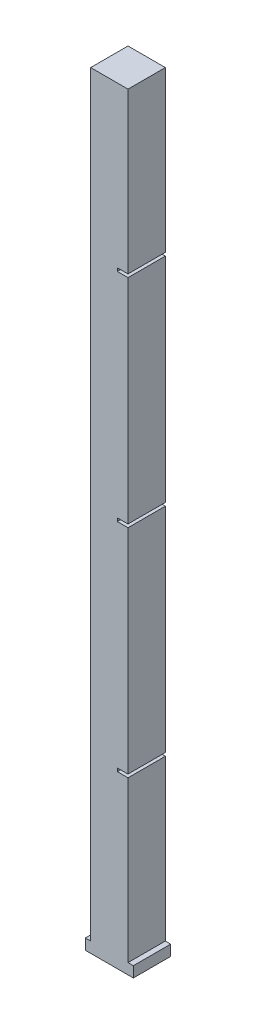
ISO-10303-21;
HEADER;
FILE_DESCRIPTION(('STEP AP214'),'2;1');
FILE_NAME('part.step','',(''),(''),'','','');
FILE_SCHEMA(('AUTOMOTIVE_DESIGN { 1 0 10303 214 1 1 1 1 }'));
ENDSEC;
DATA;
#1=APPLICATION_CONTEXT('core data for automotive mechanical design processes');
#2=APPLICATION_PROTOCOL_DEFINITION('international standard','automotive_design',2000,#1);
#3=PRODUCT_CONTEXT('',#1,'mechanical');
#4=PRODUCT('Part','Part','',(#3));
#5=PRODUCT_RELATED_PRODUCT_CATEGORY('part','',(#4));
#6=PRODUCT_DEFINITION_FORMATION('','',#4);
#7=PRODUCT_DEFINITION_CONTEXT('part definition',#1,'design');
#8=PRODUCT_DEFINITION('design','',#6,#7);
#9=PRODUCT_DEFINITION_SHAPE('','',#8);
#10=(LENGTH_UNIT() NAMED_UNIT(*) SI_UNIT(.MILLI.,.METRE.));
#11=(NAMED_UNIT(*) PLANE_ANGLE_UNIT() SI_UNIT($,.RADIAN.));
#12=(NAMED_UNIT(*) SI_UNIT($,.STERADIAN.) SOLID_ANGLE_UNIT());
#13=UNCERTAINTY_MEASURE_WITH_UNIT(LENGTH_MEASURE(1.E-05),#10,'distance_accuracy_value','');
#14=(GEOMETRIC_REPRESENTATION_CONTEXT(3) GLOBAL_UNCERTAINTY_ASSIGNED_CONTEXT((#13)) GLOBAL_UNIT_ASSIGNED_CONTEXT((#10,
#11,#12)) REPRESENTATION_CONTEXT('',''));
#15=CARTESIAN_POINT('',(0.,0.,0.));
#16=DIRECTION('',(0.,0.,1.));
#17=DIRECTION('',(1.,0.,0.));
#18=AXIS2_PLACEMENT_3D('',#15,#16,#17);
#19=CARTESIAN_POINT('',(0.,0.,70.));
#20=DIRECTION('',(1.,0.,0.));
#21=DIRECTION('',(0.,0.,-1.));
#22=AXIS2_PLACEMENT_3D('',#19,#20,#21);
#23=PLANE('',#22);
#24=DIRECTION('',(0.,-1.,0.));
#25=VECTOR('',#24,1.);
#26=CARTESIAN_POINT('',(0.,0.,0.));
#27=LINE('',#26,#25);
#28=CARTESIAN_POINT('',(0.,20.,0.));
#29=VERTEX_POINT('',#28);
#30=CARTESIAN_POINT('',(0.,0.,0.));
#31=VERTEX_POINT('',#30);
#32=EDGE_CURVE('E201',#29,#31,#27,.T.);
#33=ORIENTED_EDGE('',*,*,#32,.T.);
#34=DIRECTION('',(0.,0.,-1.));
#35=VECTOR('',#34,1.);
#36=CARTESIAN_POINT('',(0.,0.,70.));
#37=LINE('',#36,#35);
#38=CARTESIAN_POINT('',(0.,0.,70.));
#39=VERTEX_POINT('',#38);
#40=EDGE_CURVE('E11',#39,#31,#37,.T.);
#41=ORIENTED_EDGE('',*,*,#40,.F.);
#42=DIRECTION('',(0.,-1.,0.));
#43=VECTOR('',#42,1.);
#44=CARTESIAN_POINT('',(0.,0.,70.));
#45=LINE('',#44,#43);
#46=CARTESIAN_POINT('',(0.,20.,70.));
#47=VERTEX_POINT('',#46);
#48=EDGE_CURVE('E239',#47,#39,#45,.T.);
#49=ORIENTED_EDGE('',*,*,#48,.F.);
#50=DIRECTION('',(0.,0.,-1.));
#51=VECTOR('',#50,1.);
#52=CARTESIAN_POINT('',(0.,20.,70.));
#53=LINE('',#52,#51);
#54=EDGE_CURVE('E197',#47,#29,#53,.T.);
#55=ORIENTED_EDGE('',*,*,#54,.T.);
#56=EDGE_LOOP('',(#33,#41,#49,#55));
#57=FACE_BOUND('',#56,.T.);
#58=ADVANCED_FACE('F33',(#57),#23,.F.);
#59=CARTESIAN_POINT('',(0.,0.,70.));
#60=DIRECTION('',(0.,1.,0.));
#61=DIRECTION('',(0.,0.,1.));
#62=AXIS2_PLACEMENT_3D('',#59,#60,#61);
#63=PLANE('',#62);
#64=DIRECTION('',(1.,0.,0.));
#65=VECTOR('',#64,1.);
#66=CARTESIAN_POINT('',(0.,0.,0.));
#67=LINE('',#66,#65);
#68=CARTESIAN_POINT('',(90.,0.,0.));
#69=VERTEX_POINT('',#68);
#70=EDGE_CURVE('E204',#31,#69,#67,.T.);
#71=ORIENTED_EDGE('',*,*,#70,.T.);
#72=DIRECTION('',(0.,0.,-1.));
#73=VECTOR('',#72,1.);
#74=CARTESIAN_POINT('',(90.,0.,70.));
#75=LINE('',#74,#73);
#76=CARTESIAN_POINT('',(90.,0.,70.));
#77=VERTEX_POINT('',#76);
#78=EDGE_CURVE('E41',#77,#69,#75,.T.);
#79=ORIENTED_EDGE('',*,*,#78,.F.);
#80=DIRECTION('',(1.,0.,0.));
#81=VECTOR('',#80,1.);
#82=CARTESIAN_POINT('',(0.,0.,70.));
#83=LINE('',#82,#81);
#84=EDGE_CURVE('E128',#39,#77,#83,.T.);
#85=ORIENTED_EDGE('',*,*,#84,.F.);
#86=ORIENTED_EDGE('',*,*,#40,.T.);
#87=EDGE_LOOP('',(#71,#79,#85,#86));
#88=FACE_BOUND('',#87,.T.);
#89=ADVANCED_FACE('F357',(#88),#63,.F.);
#90=CARTESIAN_POINT('',(90.,0.,70.));
#91=DIRECTION('',(-1.,0.,0.));
#92=DIRECTION('',(0.,0.,1.));
#93=AXIS2_PLACEMENT_3D('',#90,#91,#92);
#94=PLANE('',#93);
#95=DIRECTION('',(0.,1.,0.));
#96=VECTOR('',#95,1.);
#97=CARTESIAN_POINT('',(90.,0.,0.));
#98=LINE('',#97,#96);
#99=CARTESIAN_POINT('',(90.,20.,0.));
#100=VERTEX_POINT('',#99);
#101=EDGE_CURVE('E206',#69,#100,#98,.T.);
#102=ORIENTED_EDGE('',*,*,#101,.T.);
#103=DIRECTION('',(0.,0.,-1.));
#104=VECTOR('',#103,1.);
#105=CARTESIAN_POINT('',(90.,20.,70.));
#106=LINE('',#105,#104);
#107=CARTESIAN_POINT('',(90.,20.,70.));
#108=VERTEX_POINT('',#107);
#109=EDGE_CURVE('E282',#108,#100,#106,.T.);
#110=ORIENTED_EDGE('',*,*,#109,.F.);
#111=DIRECTION('',(0.,1.,0.));
#112=VECTOR('',#111,1.);
#113=CARTESIAN_POINT('',(90.,0.,70.));
#114=LINE('',#113,#112);
#115=EDGE_CURVE('E290',#77,#108,#114,.T.);
#116=ORIENTED_EDGE('',*,*,#115,.F.);
#117=ORIENTED_EDGE('',*,*,#78,.T.);
#118=EDGE_LOOP('',(#102,#110,#116,#117));
#119=FACE_BOUND('',#118,.T.);
#120=ADVANCED_FACE('F288',(#119),#94,.F.);
#121=CARTESIAN_POINT('',(90.,20.,70.));
#122=DIRECTION('',(0.,-1.,0.));
#123=DIRECTION('',(0.,0.,-1.));
#124=AXIS2_PLACEMENT_3D('',#121,#122,#123);
#125=PLANE('',#124);
#126=DIRECTION('',(-1.,0.,0.));
#127=VECTOR('',#126,1.);
#128=CARTESIAN_POINT('',(90.,20.,0.));
#129=LINE('',#128,#127);
#130=CARTESIAN_POINT('',(80.,20.,0.));
#131=VERTEX_POINT('',#130);
#132=EDGE_CURVE('E208',#100,#131,#129,.T.);
#133=ORIENTED_EDGE('',*,*,#132,.T.);
#134=DIRECTION('',(0.,0.,-1.));
#135=VECTOR('',#134,1.);
#136=CARTESIAN_POINT('',(80.,20.,70.));
#137=LINE('',#136,#135);
#138=CARTESIAN_POINT('',(80.,20.,70.));
#139=VERTEX_POINT('',#138);
#140=EDGE_CURVE('E279',#139,#131,#137,.T.);
#141=ORIENTED_EDGE('',*,*,#140,.F.);
#142=DIRECTION('',(-1.,0.,0.));
#143=VECTOR('',#142,1.);
#144=CARTESIAN_POINT('',(90.,20.,70.));
#145=LINE('',#144,#143);
#146=EDGE_CURVE('E308',#108,#139,#145,.T.);
#147=ORIENTED_EDGE('',*,*,#146,.F.);
#148=ORIENTED_EDGE('',*,*,#109,.T.);
#149=EDGE_LOOP('',(#133,#141,#147,#148));
#150=FACE_BOUND('',#149,.T.);
#151=ADVANCED_FACE('F299',(#150),#125,.F.);
#152=CARTESIAN_POINT('',(80.,20.,70.));
#153=DIRECTION('',(-1.,0.,0.));
#154=DIRECTION('',(0.,0.,1.));
#155=AXIS2_PLACEMENT_3D('',#152,#153,#154);
#156=PLANE('',#155);
#157=DIRECTION('',(0.,1.,0.));
#158=VECTOR('',#157,1.);
#159=CARTESIAN_POINT('',(80.,20.,0.));
#160=LINE('',#159,#158);
#161=CARTESIAN_POINT('',(80.,320.,0.));
#162=VERTEX_POINT('',#161);
#163=EDGE_CURVE('E210',#131,#162,#160,.T.);
#164=ORIENTED_EDGE('',*,*,#163,.T.);
#165=DIRECTION('',(0.,0.,-1.));
#166=VECTOR('',#165,1.);
#167=CARTESIAN_POINT('',(80.,320.,70.));
#168=LINE('',#167,#166);
#169=CARTESIAN_POINT('',(80.,320.,70.));
#170=VERTEX_POINT('',#169);
#171=EDGE_CURVE('E276',#170,#162,#168,.T.);
#172=ORIENTED_EDGE('',*,*,#171,.F.);
#173=DIRECTION('',(0.,1.,0.));
#174=VECTOR('',#173,1.);
#175=CARTESIAN_POINT('',(80.,20.,70.));
#176=LINE('',#175,#174);
#177=EDGE_CURVE('E305',#139,#170,#176,.T.);
#178=ORIENTED_EDGE('',*,*,#177,.F.);
#179=ORIENTED_EDGE('',*,*,#140,.T.);
#180=EDGE_LOOP('',(#164,#172,#178,#179));
#181=FACE_BOUND('',#180,.T.);
#182=ADVANCED_FACE('F303',(#181),#156,.F.);
#183=CARTESIAN_POINT('',(80.,320.,70.));
#184=DIRECTION('',(0.,-1.,0.));
#185=DIRECTION('',(0.,0.,-1.));
#186=AXIS2_PLACEMENT_3D('',#183,#184,#185);
#187=PLANE('',#186);
#188=DIRECTION('',(-1.,0.,0.));
#189=VECTOR('',#188,1.);
#190=CARTESIAN_POINT('',(80.,320.,0.));
#191=LINE('',#190,#189);
#192=CARTESIAN_POINT('',(60.,320.,0.));
#193=VERTEX_POINT('',#192);
#194=EDGE_CURVE('E212',#162,#193,#191,.T.);
#195=ORIENTED_EDGE('',*,*,#194,.T.);
#196=DIRECTION('',(0.,0.,-1.));
#197=VECTOR('',#196,1.);
#198=CARTESIAN_POINT('',(60.,320.,70.));
#199=LINE('',#198,#197);
#200=CARTESIAN_POINT('',(60.,320.,70.));
#201=VERTEX_POINT('',#200);
#202=EDGE_CURVE('E273',#201,#193,#199,.T.);
#203=ORIENTED_EDGE('',*,*,#202,.F.);
#204=DIRECTION('',(-1.,0.,0.));
#205=VECTOR('',#204,1.);
#206=CARTESIAN_POINT('',(80.,320.,70.));
#207=LINE('',#206,#205);
#208=EDGE_CURVE('E307',#170,#201,#207,.T.);
#209=ORIENTED_EDGE('',*,*,#208,.F.);
#210=ORIENTED_EDGE('',*,*,#171,.T.);
#211=EDGE_LOOP('',(#195,#203,#209,#210));
#212=FACE_BOUND('',#211,.T.);
#213=ADVANCED_FACE('F370',(#212),#187,.F.);
#214=CARTESIAN_POINT('',(60.,320.,70.));
#215=DIRECTION('',(-1.,0.,0.));
#216=DIRECTION('',(0.,0.,1.));
#217=AXIS2_PLACEMENT_3D('',#214,#215,#216);
#218=PLANE('',#217);
#219=DIRECTION('',(0.,1.,0.));
#220=VECTOR('',#219,1.);
#221=CARTESIAN_POINT('',(60.,320.,0.));
#222=LINE('',#221,#220);
#223=CARTESIAN_POINT('',(60.,326.,0.));
#224=VERTEX_POINT('',#223);
#225=EDGE_CURVE('E214',#193,#224,#222,.T.);
#226=ORIENTED_EDGE('',*,*,#225,.T.);
#227=DIRECTION('',(0.,0.,-1.));
#228=VECTOR('',#227,1.);
#229=CARTESIAN_POINT('',(60.,326.,70.));
#230=LINE('',#229,#228);
#231=CARTESIAN_POINT('',(60.,326.,70.));
#232=VERTEX_POINT('',#231);
#233=EDGE_CURVE('E270',#232,#224,#230,.T.);
#234=ORIENTED_EDGE('',*,*,#233,.F.);
#235=DIRECTION('',(0.,1.,0.));
#236=VECTOR('',#235,1.);
#237=CARTESIAN_POINT('',(60.,320.,70.));
#238=LINE('',#237,#236);
#239=EDGE_CURVE('E310',#201,#232,#238,.T.);
#240=ORIENTED_EDGE('',*,*,#239,.F.);
#241=ORIENTED_EDGE('',*,*,#202,.T.);
#242=EDGE_LOOP('',(#226,#234,#240,#241));
#243=FACE_BOUND('',#242,.T.);
#244=ADVANCED_FACE('F373',(#243),#218,.F.);
#245=CARTESIAN_POINT('',(60.,326.,70.));
#246=DIRECTION('',(0.,1.,0.));
#247=DIRECTION('',(0.,0.,1.));
#248=AXIS2_PLACEMENT_3D('',#245,#246,#247);
#249=PLANE('',#248);
#250=DIRECTION('',(1.,0.,0.));
#251=VECTOR('',#250,1.);
#252=CARTESIAN_POINT('',(60.,326.,0.));
#253=LINE('',#252,#251);
#254=CARTESIAN_POINT('',(80.,326.,0.));
#255=VERTEX_POINT('',#254);
#256=EDGE_CURVE('E216',#224,#255,#253,.T.);
#257=ORIENTED_EDGE('',*,*,#256,.T.);
#258=DIRECTION('',(0.,0.,-1.));
#259=VECTOR('',#258,1.);
#260=CARTESIAN_POINT('',(80.,326.,70.));
#261=LINE('',#260,#259);
#262=CARTESIAN_POINT('',(80.,326.,70.));
#263=VERTEX_POINT('',#262);
#264=EDGE_CURVE('E267',#263,#255,#261,.T.);
#265=ORIENTED_EDGE('',*,*,#264,.F.);
#266=DIRECTION('',(1.,0.,0.));
#267=VECTOR('',#266,1.);
#268=CARTESIAN_POINT('',(60.,326.,70.));
#269=LINE('',#268,#267);
#270=EDGE_CURVE('E316',#232,#263,#269,.T.);
#271=ORIENTED_EDGE('',*,*,#270,.F.);
#272=ORIENTED_EDGE('',*,*,#233,.T.);
#273=EDGE_LOOP('',(#257,#265,#271,#272));
#274=FACE_BOUND('',#273,.T.);
#275=ADVANCED_FACE('F377',(#274),#249,.F.);
#276=CARTESIAN_POINT('',(80.,326.,70.));
#277=DIRECTION('',(-1.,0.,0.));
#278=DIRECTION('',(0.,0.,1.));
#279=AXIS2_PLACEMENT_3D('',#276,#277,#278);
#280=PLANE('',#279);
#281=DIRECTION('',(0.,1.,0.));
#282=VECTOR('',#281,1.);
#283=CARTESIAN_POINT('',(80.,326.,0.));
#284=LINE('',#283,#282);
#285=CARTESIAN_POINT('',(80.,726.,0.));
#286=VERTEX_POINT('',#285);
#287=EDGE_CURVE('E218',#255,#286,#284,.T.);
#288=ORIENTED_EDGE('',*,*,#287,.T.);
#289=DIRECTION('',(0.,0.,-1.));
#290=VECTOR('',#289,1.);
#291=CARTESIAN_POINT('',(80.,726.,70.));
#292=LINE('',#291,#290);
#293=CARTESIAN_POINT('',(80.,726.,70.));
#294=VERTEX_POINT('',#293);
#295=EDGE_CURVE('E264',#294,#286,#292,.T.);
#296=ORIENTED_EDGE('',*,*,#295,.F.);
#297=DIRECTION('',(0.,1.,0.));
#298=VECTOR('',#297,1.);
#299=CARTESIAN_POINT('',(80.,326.,70.));
#300=LINE('',#299,#298);
#301=EDGE_CURVE('E318',#263,#294,#300,.T.);
#302=ORIENTED_EDGE('',*,*,#301,.F.);
#303=ORIENTED_EDGE('',*,*,#264,.T.);
#304=EDGE_LOOP('',(#288,#296,#302,#303));
#305=FACE_BOUND('',#304,.T.);
#306=ADVANCED_FACE('F381',(#305),#280,.F.);
#307=CARTESIAN_POINT('',(80.,726.,70.));
#308=DIRECTION('',(0.,-1.,0.));
#309=DIRECTION('',(0.,0.,-1.));
#310=AXIS2_PLACEMENT_3D('',#307,#308,#309);
#311=PLANE('',#310);
#312=DIRECTION('',(-1.,0.,0.));
#313=VECTOR('',#312,1.);
#314=CARTESIAN_POINT('',(80.,726.,0.));
#315=LINE('',#314,#313);
#316=CARTESIAN_POINT('',(60.,726.,0.));
#317=VERTEX_POINT('',#316);
#318=EDGE_CURVE('E220',#286,#317,#315,.T.);
#319=ORIENTED_EDGE('',*,*,#318,.T.);
#320=DIRECTION('',(0.,0.,-1.));
#321=VECTOR('',#320,1.);
#322=CARTESIAN_POINT('',(60.,726.,70.));
#323=LINE('',#322,#321);
#324=CARTESIAN_POINT('',(60.,726.,70.));
#325=VERTEX_POINT('',#324);
#326=EDGE_CURVE('E261',#325,#317,#323,.T.);
#327=ORIENTED_EDGE('',*,*,#326,.F.);
#328=DIRECTION('',(-1.,0.,0.));
#329=VECTOR('',#328,1.);
#330=CARTESIAN_POINT('',(80.,726.,70.));
#331=LINE('',#330,#329);
#332=EDGE_CURVE('E320',#294,#325,#331,.T.);
#333=ORIENTED_EDGE('',*,*,#332,.F.);
#334=ORIENTED_EDGE('',*,*,#295,.T.);
#335=EDGE_LOOP('',(#319,#327,#333,#334));
#336=FACE_BOUND('',#335,.T.);
#337=ADVANCED_FACE('F385',(#336),#311,.F.);
#338=CARTESIAN_POINT('',(60.,726.,70.));
#339=DIRECTION('',(-1.,0.,0.));
#340=DIRECTION('',(0.,0.,1.));
#341=AXIS2_PLACEMENT_3D('',#338,#339,#340);
#342=PLANE('',#341);
#343=DIRECTION('',(0.,1.,0.));
#344=VECTOR('',#343,1.);
#345=CARTESIAN_POINT('',(60.,726.,0.));
#346=LINE('',#345,#344);
#347=CARTESIAN_POINT('',(60.,732.,0.));
#348=VERTEX_POINT('',#347);
#349=EDGE_CURVE('E222',#317,#348,#346,.T.);
#350=ORIENTED_EDGE('',*,*,#349,.T.);
#351=DIRECTION('',(0.,0.,-1.));
#352=VECTOR('',#351,1.);
#353=CARTESIAN_POINT('',(60.,732.,70.));
#354=LINE('',#353,#352);
#355=CARTESIAN_POINT('',(60.,732.,70.));
#356=VERTEX_POINT('',#355);
#357=EDGE_CURVE('E258',#356,#348,#354,.T.);
#358=ORIENTED_EDGE('',*,*,#357,.F.);
#359=DIRECTION('',(0.,1.,0.));
#360=VECTOR('',#359,1.);
#361=CARTESIAN_POINT('',(60.,726.,70.));
#362=LINE('',#361,#360);
#363=EDGE_CURVE('E322',#325,#356,#362,.T.);
#364=ORIENTED_EDGE('',*,*,#363,.F.);
#365=ORIENTED_EDGE('',*,*,#326,.T.);
#366=EDGE_LOOP('',(#350,#358,#364,#365));
#367=FACE_BOUND('',#366,.T.);
#368=ADVANCED_FACE('F389',(#367),#342,.F.);
#369=CARTESIAN_POINT('',(60.,732.,70.));
#370=DIRECTION('',(0.,1.,0.));
#371=DIRECTION('',(0.,0.,1.));
#372=AXIS2_PLACEMENT_3D('',#369,#370,#371);
#373=PLANE('',#372);
#374=DIRECTION('',(1.,0.,0.));
#375=VECTOR('',#374,1.);
#376=CARTESIAN_POINT('',(60.,732.,0.));
#377=LINE('',#376,#375);
#378=CARTESIAN_POINT('',(80.,732.,0.));
#379=VERTEX_POINT('',#378);
#380=EDGE_CURVE('E224',#348,#379,#377,.T.);
#381=ORIENTED_EDGE('',*,*,#380,.T.);
#382=DIRECTION('',(0.,0.,-1.));
#383=VECTOR('',#382,1.);
#384=CARTESIAN_POINT('',(80.,732.,70.));
#385=LINE('',#384,#383);
#386=CARTESIAN_POINT('',(80.,732.,70.));
#387=VERTEX_POINT('',#386);
#388=EDGE_CURVE('E255',#387,#379,#385,.T.);
#389=ORIENTED_EDGE('',*,*,#388,.F.);
#390=DIRECTION('',(1.,0.,0.));
#391=VECTOR('',#390,1.);
#392=CARTESIAN_POINT('',(60.,732.,70.));
#393=LINE('',#392,#391);
#394=EDGE_CURVE('E324',#356,#387,#393,.T.);
#395=ORIENTED_EDGE('',*,*,#394,.F.);
#396=ORIENTED_EDGE('',*,*,#357,.T.);
#397=EDGE_LOOP('',(#381,#389,#395,#396));
#398=FACE_BOUND('',#397,.T.);
#399=ADVANCED_FACE('F393',(#398),#373,.F.);
#400=CARTESIAN_POINT('',(80.,732.,70.));
#401=DIRECTION('',(-1.,0.,0.));
#402=DIRECTION('',(0.,0.,1.));
#403=AXIS2_PLACEMENT_3D('',#400,#401,#402);
#404=PLANE('',#403);
#405=DIRECTION('',(0.,1.,0.));
#406=VECTOR('',#405,1.);
#407=CARTESIAN_POINT('',(80.,732.,0.));
#408=LINE('',#407,#406);
#409=CARTESIAN_POINT('',(80.,1132.,0.));
#410=VERTEX_POINT('',#409);
#411=EDGE_CURVE('E226',#379,#410,#408,.T.);
#412=ORIENTED_EDGE('',*,*,#411,.T.);
#413=DIRECTION('',(0.,0.,-1.));
#414=VECTOR('',#413,1.);
#415=CARTESIAN_POINT('',(80.,1132.,70.));
#416=LINE('',#415,#414);
#417=CARTESIAN_POINT('',(80.,1132.,70.));
#418=VERTEX_POINT('',#417);
#419=EDGE_CURVE('E252',#418,#410,#416,.T.);
#420=ORIENTED_EDGE('',*,*,#419,.F.);
#421=DIRECTION('',(0.,1.,0.));
#422=VECTOR('',#421,1.);
#423=CARTESIAN_POINT('',(80.,732.,70.));
#424=LINE('',#423,#422);
#425=EDGE_CURVE('E326',#387,#418,#424,.T.);
#426=ORIENTED_EDGE('',*,*,#425,.F.);
#427=ORIENTED_EDGE('',*,*,#388,.T.);
#428=EDGE_LOOP('',(#412,#420,#426,#427));
#429=FACE_BOUND('',#428,.T.);
#430=ADVANCED_FACE('F397',(#429),#404,.F.);
#431=CARTESIAN_POINT('',(80.,1132.,70.));
#432=DIRECTION('',(0.,-1.,0.));
#433=DIRECTION('',(0.,0.,-1.));
#434=AXIS2_PLACEMENT_3D('',#431,#432,#433);
#435=PLANE('',#434);
#436=DIRECTION('',(-1.,0.,0.));
#437=VECTOR('',#436,1.);
#438=CARTESIAN_POINT('',(80.,1132.,0.));
#439=LINE('',#438,#437);
#440=CARTESIAN_POINT('',(60.,1132.,0.));
#441=VERTEX_POINT('',#440);
#442=EDGE_CURVE('E228',#410,#441,#439,.T.);
#443=ORIENTED_EDGE('',*,*,#442,.T.);
#444=DIRECTION('',(0.,0.,-1.));
#445=VECTOR('',#444,1.);
#446=CARTESIAN_POINT('',(60.,1132.,70.));
#447=LINE('',#446,#445);
#448=CARTESIAN_POINT('',(60.,1132.,70.));
#449=VERTEX_POINT('',#448);
#450=EDGE_CURVE('E249',#449,#441,#447,.T.);
#451=ORIENTED_EDGE('',*,*,#450,.F.);
#452=DIRECTION('',(-1.,0.,0.));
#453=VECTOR('',#452,1.);
#454=CARTESIAN_POINT('',(80.,1132.,70.));
#455=LINE('',#454,#453);
#456=EDGE_CURVE('E328',#418,#449,#455,.T.);
#457=ORIENTED_EDGE('',*,*,#456,.F.);
#458=ORIENTED_EDGE('',*,*,#419,.T.);
#459=EDGE_LOOP('',(#443,#451,#457,#458));
#460=FACE_BOUND('',#459,.T.);
#461=ADVANCED_FACE('F401',(#460),#435,.F.);
#462=CARTESIAN_POINT('',(60.,1132.,70.));
#463=DIRECTION('',(-1.,0.,0.));
#464=DIRECTION('',(0.,0.,1.));
#465=AXIS2_PLACEMENT_3D('',#462,#463,#464);
#466=PLANE('',#465);
#467=DIRECTION('',(0.,1.,0.));
#468=VECTOR('',#467,1.);
#469=CARTESIAN_POINT('',(60.,1132.,0.));
#470=LINE('',#469,#468);
#471=CARTESIAN_POINT('',(60.,1138.,0.));
#472=VERTEX_POINT('',#471);
#473=EDGE_CURVE('E230',#441,#472,#470,.T.);
#474=ORIENTED_EDGE('',*,*,#473,.T.);
#475=DIRECTION('',(0.,0.,-1.));
#476=VECTOR('',#475,1.);
#477=CARTESIAN_POINT('',(60.,1138.,70.));
#478=LINE('',#477,#476);
#479=CARTESIAN_POINT('',(60.,1138.,70.));
#480=VERTEX_POINT('',#479);
#481=EDGE_CURVE('E246',#480,#472,#478,.T.);
#482=ORIENTED_EDGE('',*,*,#481,.F.);
#483=DIRECTION('',(0.,1.,0.));
#484=VECTOR('',#483,1.);
#485=CARTESIAN_POINT('',(60.,1132.,70.));
#486=LINE('',#485,#484);
#487=EDGE_CURVE('E330',#449,#480,#486,.T.);
#488=ORIENTED_EDGE('',*,*,#487,.F.);
#489=ORIENTED_EDGE('',*,*,#450,.T.);
#490=EDGE_LOOP('',(#474,#482,#488,#489));
#491=FACE_BOUND('',#490,.T.);
#492=ADVANCED_FACE('F405',(#491),#466,.F.);
#493=CARTESIAN_POINT('',(60.,1138.,70.));
#494=DIRECTION('',(0.,1.,0.));
#495=DIRECTION('',(0.,0.,1.));
#496=AXIS2_PLACEMENT_3D('',#493,#494,#495);
#497=PLANE('',#496);
#498=DIRECTION('',(1.,0.,0.));
#499=VECTOR('',#498,1.);
#500=CARTESIAN_POINT('',(60.,1138.,0.));
#501=LINE('',#500,#499);
#502=CARTESIAN_POINT('',(80.,1138.,0.));
#503=VERTEX_POINT('',#502);
#504=EDGE_CURVE('E232',#472,#503,#501,.T.);
#505=ORIENTED_EDGE('',*,*,#504,.T.);
#506=DIRECTION('',(0.,0.,-1.));
#507=VECTOR('',#506,1.);
#508=CARTESIAN_POINT('',(80.,1138.,70.));
#509=LINE('',#508,#507);
#510=CARTESIAN_POINT('',(80.,1138.,70.));
#511=VERTEX_POINT('',#510);
#512=EDGE_CURVE('E243',#511,#503,#509,.T.);
#513=ORIENTED_EDGE('',*,*,#512,.F.);
#514=DIRECTION('',(1.,0.,0.));
#515=VECTOR('',#514,1.);
#516=CARTESIAN_POINT('',(60.,1138.,70.));
#517=LINE('',#516,#515);
#518=EDGE_CURVE('E332',#480,#511,#517,.T.);
#519=ORIENTED_EDGE('',*,*,#518,.F.);
#520=ORIENTED_EDGE('',*,*,#481,.T.);
#521=EDGE_LOOP('',(#505,#513,#519,#520));
#522=FACE_BOUND('',#521,.T.);
#523=ADVANCED_FACE('F338',(#522),#497,.F.);
#524=CARTESIAN_POINT('',(80.,1138.,70.));
#525=DIRECTION('',(-1.,0.,0.));
#526=DIRECTION('',(0.,0.,1.));
#527=AXIS2_PLACEMENT_3D('',#524,#525,#526);
#528=PLANE('',#527);
#529=DIRECTION('',(0.,1.,0.));
#530=VECTOR('',#529,1.);
#531=CARTESIAN_POINT('',(80.,1138.,0.));
#532=LINE('',#531,#530);
#533=CARTESIAN_POINT('',(80.,1438.,0.));
#534=VERTEX_POINT('',#533);
#535=EDGE_CURVE('E234',#503,#534,#532,.T.);
#536=ORIENTED_EDGE('',*,*,#535,.T.);
#537=DIRECTION('',(0.,0.,-1.));
#538=VECTOR('',#537,1.);
#539=CARTESIAN_POINT('',(80.,1438.,70.));
#540=LINE('',#539,#538);
#541=CARTESIAN_POINT('',(80.,1438.,70.));
#542=VERTEX_POINT('',#541);
#543=EDGE_CURVE('E192',#542,#534,#540,.T.);
#544=ORIENTED_EDGE('',*,*,#543,.F.);
#545=DIRECTION('',(0.,1.,0.));
#546=VECTOR('',#545,1.);
#547=CARTESIAN_POINT('',(80.,1138.,70.));
#548=LINE('',#547,#546);
#549=EDGE_CURVE('E183',#511,#542,#548,.T.);
#550=ORIENTED_EDGE('',*,*,#549,.F.);
#551=ORIENTED_EDGE('',*,*,#512,.T.);
#552=EDGE_LOOP('',(#536,#544,#550,#551));
#553=FACE_BOUND('',#552,.T.);
#554=ADVANCED_FACE('F342',(#553),#528,.F.);
#555=CARTESIAN_POINT('',(80.,1438.,70.));
#556=DIRECTION('',(0.,-1.,0.));
#557=DIRECTION('',(0.,0.,-1.));
#558=AXIS2_PLACEMENT_3D('',#555,#556,#557);
#559=PLANE('',#558);
#560=DIRECTION('',(-1.,0.,0.));
#561=VECTOR('',#560,1.);
#562=CARTESIAN_POINT('',(80.,1438.,0.));
#563=LINE('',#562,#561);
#564=CARTESIAN_POINT('',(10.,1438.,0.));
#565=VERTEX_POINT('',#564);
#566=EDGE_CURVE('E191',#534,#565,#563,.T.);
#567=ORIENTED_EDGE('',*,*,#566,.T.);
#568=DIRECTION('',(0.,0.,-1.));
#569=VECTOR('',#568,1.);
#570=CARTESIAN_POINT('',(10.,1438.,70.));
#571=LINE('',#570,#569);
#572=CARTESIAN_POINT('',(10.,1438.,70.));
#573=VERTEX_POINT('',#572);
#574=EDGE_CURVE('E188',#573,#565,#571,.T.);
#575=ORIENTED_EDGE('',*,*,#574,.F.);
#576=DIRECTION('',(-1.,0.,0.));
#577=VECTOR('',#576,1.);
#578=CARTESIAN_POINT('',(80.,1438.,70.));
#579=LINE('',#578,#577);
#580=EDGE_CURVE('E177',#542,#573,#579,.T.);
#581=ORIENTED_EDGE('',*,*,#580,.F.);
#582=ORIENTED_EDGE('',*,*,#543,.T.);
#583=EDGE_LOOP('',(#567,#575,#581,#582));
#584=FACE_BOUND('',#583,.T.);
#585=ADVANCED_FACE('F189',(#584),#559,.F.);
#586=CARTESIAN_POINT('',(10.,1438.,70.));
#587=DIRECTION('',(1.,0.,0.));
#588=DIRECTION('',(0.,1.,0.));
#589=AXIS2_PLACEMENT_3D('',#586,#587,#588);
#590=PLANE('',#589);
#591=DIRECTION('',(0.,-1.,0.));
#592=VECTOR('',#591,1.);
#593=CARTESIAN_POINT('',(10.,1438.,0.));
#594=LINE('',#593,#592);
#595=CARTESIAN_POINT('',(10.,20.,0.));
#596=VERTEX_POINT('',#595);
#597=EDGE_CURVE('E114',#565,#596,#594,.T.);
#598=ORIENTED_EDGE('',*,*,#597,.T.);
#599=DIRECTION('',(0.,0.,-1.));
#600=VECTOR('',#599,1.);
#601=CARTESIAN_POINT('',(10.,20.,70.));
#602=LINE('',#601,#600);
#603=CARTESIAN_POINT('',(10.,20.,70.));
#604=VERTEX_POINT('',#603);
#605=EDGE_CURVE('E193',#604,#596,#602,.T.);
#606=ORIENTED_EDGE('',*,*,#605,.F.);
#607=DIRECTION('',(0.,-1.,0.));
#608=VECTOR('',#607,1.);
#609=CARTESIAN_POINT('',(10.,1438.,70.));
#610=LINE('',#609,#608);
#611=EDGE_CURVE('E181',#573,#604,#610,.T.);
#612=ORIENTED_EDGE('',*,*,#611,.F.);
#613=ORIENTED_EDGE('',*,*,#574,.T.);
#614=EDGE_LOOP('',(#598,#606,#612,#613));
#615=FACE_BOUND('',#614,.T.);
#616=ADVANCED_FACE('F195',(#615),#590,.F.);
#617=CARTESIAN_POINT('',(0.,20.,70.));
#618=DIRECTION('',(0.,-1.,0.));
#619=DIRECTION('',(0.,0.,-1.));
#620=AXIS2_PLACEMENT_3D('',#617,#618,#619);
#621=PLANE('',#620);
#622=DIRECTION('',(-1.,0.,0.));
#623=VECTOR('',#622,1.);
#624=CARTESIAN_POINT('',(0.,20.,0.));
#625=LINE('',#624,#623);
#626=EDGE_CURVE('E120',#596,#29,#625,.T.);
#627=ORIENTED_EDGE('',*,*,#626,.T.);
#628=ORIENTED_EDGE('',*,*,#54,.F.);
#629=DIRECTION('',(-1.,0.,0.));
#630=VECTOR('',#629,1.);
#631=CARTESIAN_POINT('',(0.,20.,70.));
#632=LINE('',#631,#630);
#633=EDGE_CURVE('E49',#604,#47,#632,.T.);
#634=ORIENTED_EDGE('',*,*,#633,.F.);
#635=ORIENTED_EDGE('',*,*,#605,.T.);
#636=EDGE_LOOP('',(#627,#628,#634,#635));
#637=FACE_BOUND('',#636,.T.);
#638=ADVANCED_FACE('F346',(#637),#621,.F.);
#639=CARTESIAN_POINT('',(0.,0.,70.));
#640=DIRECTION('',(0.,0.,-1.));
#641=DIRECTION('',(-1.,0.,0.));
#642=AXIS2_PLACEMENT_3D('',#639,#640,#641);
#643=PLANE('',#642);
#644=ORIENTED_EDGE('',*,*,#48,.T.);
#645=ORIENTED_EDGE('',*,*,#84,.T.);
#646=ORIENTED_EDGE('',*,*,#115,.T.);
#647=ORIENTED_EDGE('',*,*,#146,.T.);
#648=ORIENTED_EDGE('',*,*,#177,.T.);
#649=ORIENTED_EDGE('',*,*,#208,.T.);
#650=ORIENTED_EDGE('',*,*,#239,.T.);
#651=ORIENTED_EDGE('',*,*,#270,.T.);
#652=ORIENTED_EDGE('',*,*,#301,.T.);
#653=ORIENTED_EDGE('',*,*,#332,.T.);
#654=ORIENTED_EDGE('',*,*,#363,.T.);
#655=ORIENTED_EDGE('',*,*,#394,.T.);
#656=ORIENTED_EDGE('',*,*,#425,.T.);
#657=ORIENTED_EDGE('',*,*,#456,.T.);
#658=ORIENTED_EDGE('',*,*,#487,.T.);
#659=ORIENTED_EDGE('',*,*,#518,.T.);
#660=ORIENTED_EDGE('',*,*,#549,.T.);
#661=ORIENTED_EDGE('',*,*,#580,.T.);
#662=ORIENTED_EDGE('',*,*,#611,.T.);
#663=ORIENTED_EDGE('',*,*,#633,.T.);
#664=EDGE_LOOP('',(#644,#645,#646,#647,#648,#649,#650,#651,#652,#653,#654,#655,#656,#657,#658,
#659,#660,#661,#662,#663));
#665=FACE_BOUND('',#664,.T.);
#666=ADVANCED_FACE('F179',(#665),#643,.F.);
#667=CARTESIAN_POINT('',(0.,0.,0.));
#668=DIRECTION('',(0.,0.,-1.));
#669=DIRECTION('',(-1.,0.,0.));
#670=AXIS2_PLACEMENT_3D('',#667,#668,#669);
#671=PLANE('',#670);
#672=ORIENTED_EDGE('',*,*,#32,.F.);
#673=ORIENTED_EDGE('',*,*,#626,.F.);
#674=ORIENTED_EDGE('',*,*,#597,.F.);
#675=ORIENTED_EDGE('',*,*,#566,.F.);
#676=ORIENTED_EDGE('',*,*,#535,.F.);
#677=ORIENTED_EDGE('',*,*,#504,.F.);
#678=ORIENTED_EDGE('',*,*,#473,.F.);
#679=ORIENTED_EDGE('',*,*,#442,.F.);
#680=ORIENTED_EDGE('',*,*,#411,.F.);
#681=ORIENTED_EDGE('',*,*,#380,.F.);
#682=ORIENTED_EDGE('',*,*,#349,.F.);
#683=ORIENTED_EDGE('',*,*,#318,.F.);
#684=ORIENTED_EDGE('',*,*,#287,.F.);
#685=ORIENTED_EDGE('',*,*,#256,.F.);
#686=ORIENTED_EDGE('',*,*,#225,.F.);
#687=ORIENTED_EDGE('',*,*,#194,.F.);
#688=ORIENTED_EDGE('',*,*,#163,.F.);
#689=ORIENTED_EDGE('',*,*,#132,.F.);
#690=ORIENTED_EDGE('',*,*,#101,.F.);
#691=ORIENTED_EDGE('',*,*,#70,.F.);
#692=EDGE_LOOP('',(#672,#673,#674,#675,#676,#677,#678,#679,#680,#681,#682,#683,#684,#685,#686,
#687,#688,#689,#690,#691));
#693=FACE_BOUND('',#692,.T.);
#694=ADVANCED_FACE('F294',(#693),#671,.T.);
#695=CLOSED_SHELL('',(#58,#89,#120,#151,#182,#213,#244,#275,#306,#337,#368,#399,#430,#461,#492,
#523,#554,#585,#616,#638,#666,#694));
#696=MANIFOLD_SOLID_BREP('B2',#695);
#697=ADVANCED_BREP_SHAPE_REPRESENTATION('',(#18,#696),#14);
#698=SHAPE_DEFINITION_REPRESENTATION(#9,#697);
ENDSEC;
END-ISO-10303-21;
